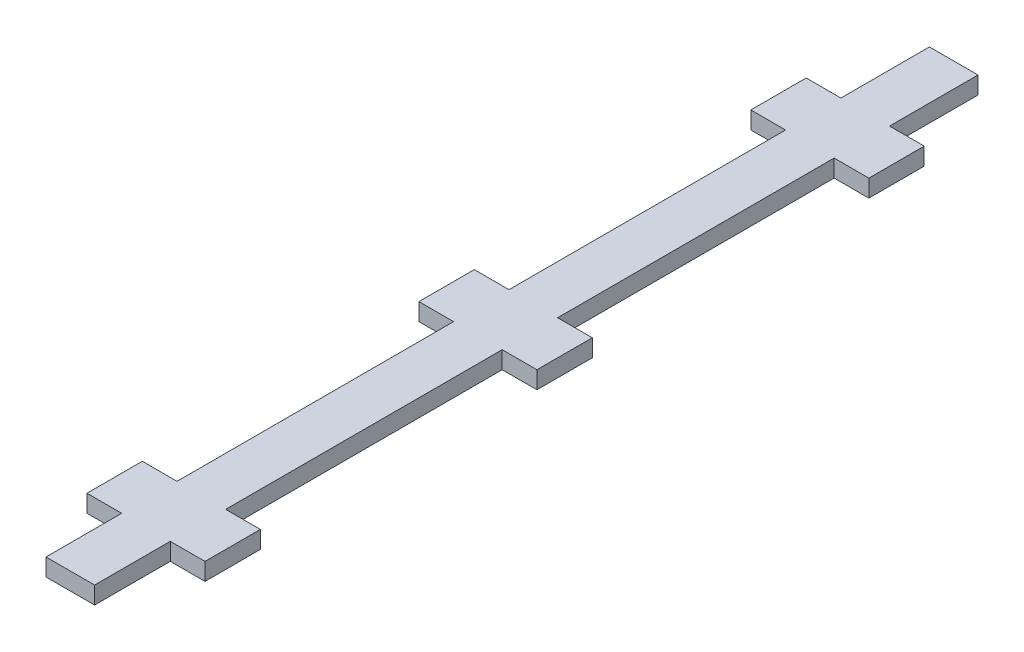
ISO-10303-21;
HEADER;
FILE_DESCRIPTION(('STEP AP214'),'2;1');
FILE_NAME('part.step','',(''),(''),'','','');
FILE_SCHEMA(('AUTOMOTIVE_DESIGN { 1 0 10303 214 1 1 1 1 }'));
ENDSEC;
DATA;
#1=APPLICATION_CONTEXT('core data for automotive mechanical design processes');
#2=APPLICATION_PROTOCOL_DEFINITION('international standard','automotive_design',2000,#1);
#3=PRODUCT_CONTEXT('',#1,'mechanical');
#4=PRODUCT('Part','Part','',(#3));
#5=PRODUCT_RELATED_PRODUCT_CATEGORY('part','',(#4));
#6=PRODUCT_DEFINITION_FORMATION('','',#4);
#7=PRODUCT_DEFINITION_CONTEXT('part definition',#1,'design');
#8=PRODUCT_DEFINITION('design','',#6,#7);
#9=PRODUCT_DEFINITION_SHAPE('','',#8);
#10=(LENGTH_UNIT() NAMED_UNIT(*) SI_UNIT(.MILLI.,.METRE.));
#11=(NAMED_UNIT(*) PLANE_ANGLE_UNIT() SI_UNIT($,.RADIAN.));
#12=(NAMED_UNIT(*) SI_UNIT($,.STERADIAN.) SOLID_ANGLE_UNIT());
#13=UNCERTAINTY_MEASURE_WITH_UNIT(LENGTH_MEASURE(1.E-05),#10,'distance_accuracy_value','');
#14=(GEOMETRIC_REPRESENTATION_CONTEXT(3) GLOBAL_UNCERTAINTY_ASSIGNED_CONTEXT((#13)) GLOBAL_UNIT_ASSIGNED_CONTEXT((#10,
#11,#12)) REPRESENTATION_CONTEXT('',''));
#15=CARTESIAN_POINT('',(0.,0.,0.));
#16=DIRECTION('',(0.,0.,1.));
#17=DIRECTION('',(1.,0.,0.));
#18=AXIS2_PLACEMENT_3D('',#15,#16,#17);
#19=CARTESIAN_POINT('',(-4.445,3.175,0.));
#20=DIRECTION('',(1.,0.,0.));
#21=DIRECTION('',(0.,0.,-1.));
#22=AXIS2_PLACEMENT_3D('',#19,#20,#21);
#23=PLANE('',#22);
#24=DIRECTION('',(0.,0.,1.));
#25=VECTOR('',#24,1.);
#26=CARTESIAN_POINT('',(-4.445,0.,0.));
#27=LINE('',#26,#25);
#28=CARTESIAN_POINT('',(-4.445,0.,-13.843));
#29=VERTEX_POINT('',#28);
#30=CARTESIAN_POINT('',(-4.445,0.,0.));
#31=VERTEX_POINT('',#30);
#32=EDGE_CURVE('E249',#29,#31,#27,.T.);
#33=ORIENTED_EDGE('',*,*,#32,.T.);
#34=DIRECTION('',(0.,-1.,0.));
#35=VECTOR('',#34,1.);
#36=CARTESIAN_POINT('',(-4.445,3.175,0.));
#37=LINE('',#36,#35);
#38=CARTESIAN_POINT('',(-4.445,3.175,0.));
#39=VERTEX_POINT('',#38);
#40=EDGE_CURVE('E11',#39,#31,#37,.T.);
#41=ORIENTED_EDGE('',*,*,#40,.F.);
#42=DIRECTION('',(0.,0.,1.));
#43=VECTOR('',#42,1.);
#44=CARTESIAN_POINT('',(-4.445,3.175,0.));
#45=LINE('',#44,#43);
#46=CARTESIAN_POINT('',(-4.445,3.175,-13.843));
#47=VERTEX_POINT('',#46);
#48=EDGE_CURVE('E303',#47,#39,#45,.T.);
#49=ORIENTED_EDGE('',*,*,#48,.F.);
#50=DIRECTION('',(0.,-1.,0.));
#51=VECTOR('',#50,1.);
#52=CARTESIAN_POINT('',(-4.445,3.175,-13.843));
#53=LINE('',#52,#51);
#54=EDGE_CURVE('E245',#47,#29,#53,.T.);
#55=ORIENTED_EDGE('',*,*,#54,.T.);
#56=EDGE_LOOP('',(#33,#41,#49,#55));
#57=FACE_BOUND('',#56,.T.);
#58=ADVANCED_FACE('F33',(#57),#23,.F.);
#59=CARTESIAN_POINT('',(4.445,3.175,0.));
#60=DIRECTION('',(0.,0.,-1.));
#61=DIRECTION('',(-1.,0.,0.));
#62=AXIS2_PLACEMENT_3D('',#59,#60,#61);
#63=PLANE('',#62);
#64=DIRECTION('',(1.,0.,0.));
#65=VECTOR('',#64,1.);
#66=CARTESIAN_POINT('',(4.445,0.,0.));
#67=LINE('',#66,#65);
#68=CARTESIAN_POINT('',(4.445,0.,0.));
#69=VERTEX_POINT('',#68);
#70=EDGE_CURVE('E252',#31,#69,#67,.T.);
#71=ORIENTED_EDGE('',*,*,#70,.T.);
#72=DIRECTION('',(0.,-1.,0.));
#73=VECTOR('',#72,1.);
#74=CARTESIAN_POINT('',(4.445,3.175,0.));
#75=LINE('',#74,#73);
#76=CARTESIAN_POINT('',(4.445,3.175,0.));
#77=VERTEX_POINT('',#76);
#78=EDGE_CURVE('E41',#77,#69,#75,.T.);
#79=ORIENTED_EDGE('',*,*,#78,.F.);
#80=DIRECTION('',(1.,0.,0.));
#81=VECTOR('',#80,1.);
#82=CARTESIAN_POINT('',(4.445,3.175,0.));
#83=LINE('',#82,#81);
#84=EDGE_CURVE('E152',#39,#77,#83,.T.);
#85=ORIENTED_EDGE('',*,*,#84,.F.);
#86=ORIENTED_EDGE('',*,*,#40,.T.);
#87=EDGE_LOOP('',(#71,#79,#85,#86));
#88=FACE_BOUND('',#87,.T.);
#89=ADVANCED_FACE('F461',(#88),#63,.F.);
#90=CARTESIAN_POINT('',(4.445,3.175,0.));
#91=DIRECTION('',(-1.,0.,0.));
#92=DIRECTION('',(0.,0.,1.));
#93=AXIS2_PLACEMENT_3D('',#90,#91,#92);
#94=PLANE('',#93);
#95=DIRECTION('',(0.,0.,-1.));
#96=VECTOR('',#95,1.);
#97=CARTESIAN_POINT('',(4.445,0.,0.));
#98=LINE('',#97,#96);
#99=CARTESIAN_POINT('',(4.445,0.,-13.843));
#100=VERTEX_POINT('',#99);
#101=EDGE_CURVE('E254',#69,#100,#98,.T.);
#102=ORIENTED_EDGE('',*,*,#101,.T.);
#103=DIRECTION('',(0.,-1.,0.));
#104=VECTOR('',#103,1.);
#105=CARTESIAN_POINT('',(4.445,3.175,-13.843));
#106=LINE('',#105,#104);
#107=CARTESIAN_POINT('',(4.445,3.175,-13.843));
#108=VERTEX_POINT('',#107);
#109=EDGE_CURVE('E370',#108,#100,#106,.T.);
#110=ORIENTED_EDGE('',*,*,#109,.F.);
#111=DIRECTION('',(0.,0.,-1.));
#112=VECTOR('',#111,1.);
#113=CARTESIAN_POINT('',(4.445,3.175,0.));
#114=LINE('',#113,#112);
#115=EDGE_CURVE('E378',#77,#108,#114,.T.);
#116=ORIENTED_EDGE('',*,*,#115,.F.);
#117=ORIENTED_EDGE('',*,*,#78,.T.);
#118=EDGE_LOOP('',(#102,#110,#116,#117));
#119=FACE_BOUND('',#118,.T.);
#120=ADVANCED_FACE('F376',(#119),#94,.F.);
#121=CARTESIAN_POINT('',(4.445,3.175,-13.843));
#122=DIRECTION('',(0.,0.,-1.));
#123=DIRECTION('',(-1.,0.,0.));
#124=AXIS2_PLACEMENT_3D('',#121,#122,#123);
#125=PLANE('',#124);
#126=DIRECTION('',(1.,0.,0.));
#127=VECTOR('',#126,1.);
#128=CARTESIAN_POINT('',(4.445,0.,-13.843));
#129=LINE('',#128,#127);
#130=CARTESIAN_POINT('',(10.795,0.,-13.843));
#131=VERTEX_POINT('',#130);
#132=EDGE_CURVE('E256',#100,#131,#129,.T.);
#133=ORIENTED_EDGE('',*,*,#132,.T.);
#134=DIRECTION('',(0.,-1.,0.));
#135=VECTOR('',#134,1.);
#136=CARTESIAN_POINT('',(10.795,3.175,-13.843));
#137=LINE('',#136,#135);
#138=CARTESIAN_POINT('',(10.795,3.175,-13.843));
#139=VERTEX_POINT('',#138);
#140=EDGE_CURVE('E367',#139,#131,#137,.T.);
#141=ORIENTED_EDGE('',*,*,#140,.F.);
#142=DIRECTION('',(1.,0.,0.));
#143=VECTOR('',#142,1.);
#144=CARTESIAN_POINT('',(4.445,3.175,-13.843));
#145=LINE('',#144,#143);
#146=EDGE_CURVE('E396',#108,#139,#145,.T.);
#147=ORIENTED_EDGE('',*,*,#146,.F.);
#148=ORIENTED_EDGE('',*,*,#109,.T.);
#149=EDGE_LOOP('',(#133,#141,#147,#148));
#150=FACE_BOUND('',#149,.T.);
#151=ADVANCED_FACE('F387',(#150),#125,.F.);
#152=CARTESIAN_POINT('',(10.795,3.175,-13.843));
#153=DIRECTION('',(-1.,0.,0.));
#154=DIRECTION('',(0.,0.,1.));
#155=AXIS2_PLACEMENT_3D('',#152,#153,#154);
#156=PLANE('',#155);
#157=DIRECTION('',(0.,0.,-1.));
#158=VECTOR('',#157,1.);
#159=CARTESIAN_POINT('',(10.795,0.,-13.843));
#160=LINE('',#159,#158);
#161=CARTESIAN_POINT('',(10.795,0.,-23.974869246));
#162=VERTEX_POINT('',#161);
#163=EDGE_CURVE('E258',#131,#162,#160,.T.);
#164=ORIENTED_EDGE('',*,*,#163,.T.);
#165=DIRECTION('',(0.,-1.,0.));
#166=VECTOR('',#165,1.);
#167=CARTESIAN_POINT('',(10.795,3.175,-23.974869246));
#168=LINE('',#167,#166);
#169=CARTESIAN_POINT('',(10.795,3.175,-23.974869246));
#170=VERTEX_POINT('',#169);
#171=EDGE_CURVE('E364',#170,#162,#168,.T.);
#172=ORIENTED_EDGE('',*,*,#171,.F.);
#173=DIRECTION('',(0.,0.,-1.));
#174=VECTOR('',#173,1.);
#175=CARTESIAN_POINT('',(10.795,3.175,-13.843));
#176=LINE('',#175,#174);
#177=EDGE_CURVE('E393',#139,#170,#176,.T.);
#178=ORIENTED_EDGE('',*,*,#177,.F.);
#179=ORIENTED_EDGE('',*,*,#140,.T.);
#180=EDGE_LOOP('',(#164,#172,#178,#179));
#181=FACE_BOUND('',#180,.T.);
#182=ADVANCED_FACE('F391',(#181),#156,.F.);
#183=CARTESIAN_POINT('',(10.795,3.175,-23.974869246));
#184=DIRECTION('',(0.,0.,1.));
#185=DIRECTION('',(1.,0.,0.));
#186=AXIS2_PLACEMENT_3D('',#183,#184,#185);
#187=PLANE('',#186);
#188=DIRECTION('',(-1.,0.,0.));
#189=VECTOR('',#188,1.);
#190=CARTESIAN_POINT('',(10.795,0.,-23.974869246));
#191=LINE('',#190,#189);
#192=CARTESIAN_POINT('',(4.445,0.,-23.974869246));
#193=VERTEX_POINT('',#192);
#194=EDGE_CURVE('E260',#162,#193,#191,.T.);
#195=ORIENTED_EDGE('',*,*,#194,.T.);
#196=DIRECTION('',(0.,-1.,0.));
#197=VECTOR('',#196,1.);
#198=CARTESIAN_POINT('',(4.445,3.175,-23.974869246));
#199=LINE('',#198,#197);
#200=CARTESIAN_POINT('',(4.445,3.175,-23.974869246));
#201=VERTEX_POINT('',#200);
#202=EDGE_CURVE('E361',#201,#193,#199,.T.);
#203=ORIENTED_EDGE('',*,*,#202,.F.);
#204=DIRECTION('',(-1.,0.,0.));
#205=VECTOR('',#204,1.);
#206=CARTESIAN_POINT('',(10.795,3.175,-23.974869246));
#207=LINE('',#206,#205);
#208=EDGE_CURVE('E395',#170,#201,#207,.T.);
#209=ORIENTED_EDGE('',*,*,#208,.F.);
#210=ORIENTED_EDGE('',*,*,#171,.T.);
#211=EDGE_LOOP('',(#195,#203,#209,#210));
#212=FACE_BOUND('',#211,.T.);
#213=ADVANCED_FACE('F474',(#212),#187,.F.);
#214=CARTESIAN_POINT('',(4.445,3.175,-23.974869246));
#215=DIRECTION('',(-1.,0.,0.));
#216=DIRECTION('',(0.,0.,1.));
#217=AXIS2_PLACEMENT_3D('',#214,#215,#216);
#218=PLANE('',#217);
#219=DIRECTION('',(0.,0.,-1.));
#220=VECTOR('',#219,1.);
#221=CARTESIAN_POINT('',(4.445,0.,-23.974869246));
#222=LINE('',#221,#220);
#223=CARTESIAN_POINT('',(4.445,0.,-74.564887446));
#224=VERTEX_POINT('',#223);
#225=EDGE_CURVE('E262',#193,#224,#222,.T.);
#226=ORIENTED_EDGE('',*,*,#225,.T.);
#227=DIRECTION('',(0.,-1.,0.));
#228=VECTOR('',#227,1.);
#229=CARTESIAN_POINT('',(4.445,3.175,-74.564887446));
#230=LINE('',#229,#228);
#231=CARTESIAN_POINT('',(4.445,3.175,-74.564887446));
#232=VERTEX_POINT('',#231);
#233=EDGE_CURVE('E358',#232,#224,#230,.T.);
#234=ORIENTED_EDGE('',*,*,#233,.F.);
#235=DIRECTION('',(0.,0.,-1.));
#236=VECTOR('',#235,1.);
#237=CARTESIAN_POINT('',(4.445,3.175,-23.974869246));
#238=LINE('',#237,#236);
#239=EDGE_CURVE('E398',#201,#232,#238,.T.);
#240=ORIENTED_EDGE('',*,*,#239,.F.);
#241=ORIENTED_EDGE('',*,*,#202,.T.);
#242=EDGE_LOOP('',(#226,#234,#240,#241));
#243=FACE_BOUND('',#242,.T.);
#244=ADVANCED_FACE('F477',(#243),#218,.F.);
#245=CARTESIAN_POINT('',(4.445,3.175,-74.564887446));
#246=DIRECTION('',(0.,0.,-1.));
#247=DIRECTION('',(-1.,0.,0.));
#248=AXIS2_PLACEMENT_3D('',#245,#246,#247);
#249=PLANE('',#248);
#250=DIRECTION('',(1.,0.,0.));
#251=VECTOR('',#250,1.);
#252=CARTESIAN_POINT('',(4.445,0.,-74.564887446));
#253=LINE('',#252,#251);
#254=CARTESIAN_POINT('',(10.795,0.,-74.564887446));
#255=VERTEX_POINT('',#254);
#256=EDGE_CURVE('E264',#224,#255,#253,.T.);
#257=ORIENTED_EDGE('',*,*,#256,.T.);
#258=DIRECTION('',(0.,-1.,0.));
#259=VECTOR('',#258,1.);
#260=CARTESIAN_POINT('',(10.795,3.175,-74.564887446));
#261=LINE('',#260,#259);
#262=CARTESIAN_POINT('',(10.795,3.175,-74.564887446));
#263=VERTEX_POINT('',#262);
#264=EDGE_CURVE('E355',#263,#255,#261,.T.);
#265=ORIENTED_EDGE('',*,*,#264,.F.);
#266=DIRECTION('',(1.,0.,0.));
#267=VECTOR('',#266,1.);
#268=CARTESIAN_POINT('',(4.445,3.175,-74.564887446));
#269=LINE('',#268,#267);
#270=EDGE_CURVE('E404',#232,#263,#269,.T.);
#271=ORIENTED_EDGE('',*,*,#270,.F.);
#272=ORIENTED_EDGE('',*,*,#233,.T.);
#273=EDGE_LOOP('',(#257,#265,#271,#272));
#274=FACE_BOUND('',#273,.T.);
#275=ADVANCED_FACE('F481',(#274),#249,.F.);
#276=CARTESIAN_POINT('',(10.795,3.175,-74.564887446));
#277=DIRECTION('',(-1.,0.,0.));
#278=DIRECTION('',(0.,0.,1.));
#279=AXIS2_PLACEMENT_3D('',#276,#277,#278);
#280=PLANE('',#279);
#281=DIRECTION('',(0.,0.,-1.));
#282=VECTOR('',#281,1.);
#283=CARTESIAN_POINT('',(10.795,0.,-74.564887446));
#284=LINE('',#283,#282);
#285=CARTESIAN_POINT('',(10.795,0.,-84.696756692));
#286=VERTEX_POINT('',#285);
#287=EDGE_CURVE('E266',#255,#286,#284,.T.);
#288=ORIENTED_EDGE('',*,*,#287,.T.);
#289=DIRECTION('',(0.,-1.,0.));
#290=VECTOR('',#289,1.);
#291=CARTESIAN_POINT('',(10.795,3.175,-84.696756692));
#292=LINE('',#291,#290);
#293=CARTESIAN_POINT('',(10.795,3.175,-84.696756692));
#294=VERTEX_POINT('',#293);
#295=EDGE_CURVE('E352',#294,#286,#292,.T.);
#296=ORIENTED_EDGE('',*,*,#295,.F.);
#297=DIRECTION('',(0.,0.,-1.));
#298=VECTOR('',#297,1.);
#299=CARTESIAN_POINT('',(10.795,3.175,-74.564887446));
#300=LINE('',#299,#298);
#301=EDGE_CURVE('E406',#263,#294,#300,.T.);
#302=ORIENTED_EDGE('',*,*,#301,.F.);
#303=ORIENTED_EDGE('',*,*,#264,.T.);
#304=EDGE_LOOP('',(#288,#296,#302,#303));
#305=FACE_BOUND('',#304,.T.);
#306=ADVANCED_FACE('F485',(#305),#280,.F.);
#307=CARTESIAN_POINT('',(10.795,3.175,-84.696756692));
#308=DIRECTION('',(0.,0.,1.));
#309=DIRECTION('',(1.,0.,0.));
#310=AXIS2_PLACEMENT_3D('',#307,#308,#309);
#311=PLANE('',#310);
#312=DIRECTION('',(-1.,0.,0.));
#313=VECTOR('',#312,1.);
#314=CARTESIAN_POINT('',(10.795,0.,-84.696756692));
#315=LINE('',#314,#313);
#316=CARTESIAN_POINT('',(4.445,0.,-84.696756692));
#317=VERTEX_POINT('',#316);
#318=EDGE_CURVE('E268',#286,#317,#315,.T.);
#319=ORIENTED_EDGE('',*,*,#318,.T.);
#320=DIRECTION('',(0.,-1.,0.));
#321=VECTOR('',#320,1.);
#322=CARTESIAN_POINT('',(4.445,3.175,-84.696756692));
#323=LINE('',#322,#321);
#324=CARTESIAN_POINT('',(4.445,3.175,-84.696756692));
#325=VERTEX_POINT('',#324);
#326=EDGE_CURVE('E349',#325,#317,#323,.T.);
#327=ORIENTED_EDGE('',*,*,#326,.F.);
#328=DIRECTION('',(-1.,0.,0.));
#329=VECTOR('',#328,1.);
#330=CARTESIAN_POINT('',(10.795,3.175,-84.696756692));
#331=LINE('',#330,#329);
#332=EDGE_CURVE('E408',#294,#325,#331,.T.);
#333=ORIENTED_EDGE('',*,*,#332,.F.);
#334=ORIENTED_EDGE('',*,*,#295,.T.);
#335=EDGE_LOOP('',(#319,#327,#333,#334));
#336=FACE_BOUND('',#335,.T.);
#337=ADVANCED_FACE('F489',(#336),#311,.F.);
#338=CARTESIAN_POINT('',(4.445,3.175,-84.696756692));
#339=DIRECTION('',(-1.,0.,0.));
#340=DIRECTION('',(0.,0.,1.));
#341=AXIS2_PLACEMENT_3D('',#338,#339,#340);
#342=PLANE('',#341);
#343=DIRECTION('',(0.,0.,-1.));
#344=VECTOR('',#343,1.);
#345=CARTESIAN_POINT('',(4.445,0.,-84.696756692));
#346=LINE('',#345,#344);
#347=CARTESIAN_POINT('',(4.445,0.,-135.286774892));
#348=VERTEX_POINT('',#347);
#349=EDGE_CURVE('E270',#317,#348,#346,.T.);
#350=ORIENTED_EDGE('',*,*,#349,.T.);
#351=DIRECTION('',(0.,-1.,0.));
#352=VECTOR('',#351,1.);
#353=CARTESIAN_POINT('',(4.445,3.175,-135.286774892));
#354=LINE('',#353,#352);
#355=CARTESIAN_POINT('',(4.445,3.175,-135.286774892));
#356=VERTEX_POINT('',#355);
#357=EDGE_CURVE('E346',#356,#348,#354,.T.);
#358=ORIENTED_EDGE('',*,*,#357,.F.);
#359=DIRECTION('',(0.,0.,-1.));
#360=VECTOR('',#359,1.);
#361=CARTESIAN_POINT('',(4.445,3.175,-84.696756692));
#362=LINE('',#361,#360);
#363=EDGE_CURVE('E410',#325,#356,#362,.T.);
#364=ORIENTED_EDGE('',*,*,#363,.F.);
#365=ORIENTED_EDGE('',*,*,#326,.T.);
#366=EDGE_LOOP('',(#350,#358,#364,#365));
#367=FACE_BOUND('',#366,.T.);
#368=ADVANCED_FACE('F493',(#367),#342,.F.);
#369=CARTESIAN_POINT('',(4.445,3.175,-135.286774892));
#370=DIRECTION('',(0.,0.,-1.));
#371=DIRECTION('',(-1.,0.,0.));
#372=AXIS2_PLACEMENT_3D('',#369,#370,#371);
#373=PLANE('',#372);
#374=DIRECTION('',(1.,0.,0.));
#375=VECTOR('',#374,1.);
#376=CARTESIAN_POINT('',(4.445,0.,-135.286774892));
#377=LINE('',#376,#375);
#378=CARTESIAN_POINT('',(10.795,0.,-135.286774892));
#379=VERTEX_POINT('',#378);
#380=EDGE_CURVE('E272',#348,#379,#377,.T.);
#381=ORIENTED_EDGE('',*,*,#380,.T.);
#382=DIRECTION('',(0.,-1.,0.));
#383=VECTOR('',#382,1.);
#384=CARTESIAN_POINT('',(10.795,3.175,-135.286774892));
#385=LINE('',#384,#383);
#386=CARTESIAN_POINT('',(10.795,3.175,-135.286774892));
#387=VERTEX_POINT('',#386);
#388=EDGE_CURVE('E343',#387,#379,#385,.T.);
#389=ORIENTED_EDGE('',*,*,#388,.F.);
#390=DIRECTION('',(1.,0.,0.));
#391=VECTOR('',#390,1.);
#392=CARTESIAN_POINT('',(4.445,3.175,-135.286774892));
#393=LINE('',#392,#391);
#394=EDGE_CURVE('E412',#356,#387,#393,.T.);
#395=ORIENTED_EDGE('',*,*,#394,.F.);
#396=ORIENTED_EDGE('',*,*,#357,.T.);
#397=EDGE_LOOP('',(#381,#389,#395,#396));
#398=FACE_BOUND('',#397,.T.);
#399=ADVANCED_FACE('F497',(#398),#373,.F.);
#400=CARTESIAN_POINT('',(10.795,3.175,-135.286774892));
#401=DIRECTION('',(-1.,0.,0.));
#402=DIRECTION('',(0.,0.,1.));
#403=AXIS2_PLACEMENT_3D('',#400,#401,#402);
#404=PLANE('',#403);
#405=DIRECTION('',(0.,0.,-1.));
#406=VECTOR('',#405,1.);
#407=CARTESIAN_POINT('',(10.795,0.,-135.286774892));
#408=LINE('',#407,#406);
#409=CARTESIAN_POINT('',(10.795,0.,-145.418644138));
#410=VERTEX_POINT('',#409);
#411=EDGE_CURVE('E274',#379,#410,#408,.T.);
#412=ORIENTED_EDGE('',*,*,#411,.T.);
#413=DIRECTION('',(0.,-1.,0.));
#414=VECTOR('',#413,1.);
#415=CARTESIAN_POINT('',(10.795,3.175,-145.418644138));
#416=LINE('',#415,#414);
#417=CARTESIAN_POINT('',(10.795,3.175,-145.418644138));
#418=VERTEX_POINT('',#417);
#419=EDGE_CURVE('E340',#418,#410,#416,.T.);
#420=ORIENTED_EDGE('',*,*,#419,.F.);
#421=DIRECTION('',(0.,0.,-1.));
#422=VECTOR('',#421,1.);
#423=CARTESIAN_POINT('',(10.795,3.175,-135.286774892));
#424=LINE('',#423,#422);
#425=EDGE_CURVE('E414',#387,#418,#424,.T.);
#426=ORIENTED_EDGE('',*,*,#425,.F.);
#427=ORIENTED_EDGE('',*,*,#388,.T.);
#428=EDGE_LOOP('',(#412,#420,#426,#427));
#429=FACE_BOUND('',#428,.T.);
#430=ADVANCED_FACE('F501',(#429),#404,.F.);
#431=CARTESIAN_POINT('',(10.795,3.175,-145.418644138));
#432=DIRECTION('',(0.,0.,1.));
#433=DIRECTION('',(1.,0.,0.));
#434=AXIS2_PLACEMENT_3D('',#431,#432,#433);
#435=PLANE('',#434);
#436=DIRECTION('',(-1.,0.,0.));
#437=VECTOR('',#436,1.);
#438=CARTESIAN_POINT('',(10.795,0.,-145.418644138));
#439=LINE('',#438,#437);
#440=CARTESIAN_POINT('',(4.445,0.,-145.418644138));
#441=VERTEX_POINT('',#440);
#442=EDGE_CURVE('E276',#410,#441,#439,.T.);
#443=ORIENTED_EDGE('',*,*,#442,.T.);
#444=DIRECTION('',(0.,-1.,0.));
#445=VECTOR('',#444,1.);
#446=CARTESIAN_POINT('',(4.445,3.175,-145.418644138));
#447=LINE('',#446,#445);
#448=CARTESIAN_POINT('',(4.445,3.175,-145.418644138));
#449=VERTEX_POINT('',#448);
#450=EDGE_CURVE('E337',#449,#441,#447,.T.);
#451=ORIENTED_EDGE('',*,*,#450,.F.);
#452=DIRECTION('',(-1.,0.,0.));
#453=VECTOR('',#452,1.);
#454=CARTESIAN_POINT('',(10.795,3.175,-145.418644138));
#455=LINE('',#454,#453);
#456=EDGE_CURVE('E416',#418,#449,#455,.T.);
#457=ORIENTED_EDGE('',*,*,#456,.F.);
#458=ORIENTED_EDGE('',*,*,#419,.T.);
#459=EDGE_LOOP('',(#443,#451,#457,#458));
#460=FACE_BOUND('',#459,.T.);
#461=ADVANCED_FACE('F505',(#460),#435,.F.);
#462=CARTESIAN_POINT('',(4.445,3.175,-145.418644138));
#463=DIRECTION('',(-1.,0.,0.));
#464=DIRECTION('',(0.,0.,1.));
#465=AXIS2_PLACEMENT_3D('',#462,#463,#464);
#466=PLANE('',#465);
#467=DIRECTION('',(0.,0.,-1.));
#468=VECTOR('',#467,1.);
#469=CARTESIAN_POINT('',(4.445,0.,-145.418644138));
#470=LINE('',#469,#468);
#471=CARTESIAN_POINT('',(4.445,0.,-161.605283342));
#472=VERTEX_POINT('',#471);
#473=EDGE_CURVE('E278',#441,#472,#470,.T.);
#474=ORIENTED_EDGE('',*,*,#473,.T.);
#475=DIRECTION('',(0.,-1.,0.));
#476=VECTOR('',#475,1.);
#477=CARTESIAN_POINT('',(4.445,3.175,-161.605283342));
#478=LINE('',#477,#476);
#479=CARTESIAN_POINT('',(4.445,3.175,-161.605283342));
#480=VERTEX_POINT('',#479);
#481=EDGE_CURVE('E334',#480,#472,#478,.T.);
#482=ORIENTED_EDGE('',*,*,#481,.F.);
#483=DIRECTION('',(0.,0.,-1.));
#484=VECTOR('',#483,1.);
#485=CARTESIAN_POINT('',(4.445,3.175,-145.418644138));
#486=LINE('',#485,#484);
#487=EDGE_CURVE('E418',#449,#480,#486,.T.);
#488=ORIENTED_EDGE('',*,*,#487,.F.);
#489=ORIENTED_EDGE('',*,*,#450,.T.);
#490=EDGE_LOOP('',(#474,#482,#488,#489));
#491=FACE_BOUND('',#490,.T.);
#492=ADVANCED_FACE('F509',(#491),#466,.F.);
#493=CARTESIAN_POINT('',(-4.445,3.175,-161.605283342));
#494=DIRECTION('',(0.,0.,1.));
#495=DIRECTION('',(1.,0.,0.));
#496=AXIS2_PLACEMENT_3D('',#493,#494,#495);
#497=PLANE('',#496);
#498=DIRECTION('',(-1.,0.,0.));
#499=VECTOR('',#498,1.);
#500=CARTESIAN_POINT('',(-4.445,0.,-161.605283342));
#501=LINE('',#500,#499);
#502=CARTESIAN_POINT('',(-4.445,0.,-161.605283342));
#503=VERTEX_POINT('',#502);
#504=EDGE_CURVE('E280',#472,#503,#501,.T.);
#505=ORIENTED_EDGE('',*,*,#504,.T.);
#506=DIRECTION('',(0.,-1.,0.));
#507=VECTOR('',#506,1.);
#508=CARTESIAN_POINT('',(-4.445,3.175,-161.605283342));
#509=LINE('',#508,#507);
#510=CARTESIAN_POINT('',(-4.445,3.175,-161.605283342));
#511=VERTEX_POINT('',#510);
#512=EDGE_CURVE('E331',#511,#503,#509,.T.);
#513=ORIENTED_EDGE('',*,*,#512,.F.);
#514=DIRECTION('',(-1.,0.,0.));
#515=VECTOR('',#514,1.);
#516=CARTESIAN_POINT('',(-4.445,3.175,-161.605283342));
#517=LINE('',#516,#515);
#518=EDGE_CURVE('E420',#480,#511,#517,.T.);
#519=ORIENTED_EDGE('',*,*,#518,.F.);
#520=ORIENTED_EDGE('',*,*,#481,.T.);
#521=EDGE_LOOP('',(#505,#513,#519,#520));
#522=FACE_BOUND('',#521,.T.);
#523=ADVANCED_FACE('F513',(#522),#497,.F.);
#524=CARTESIAN_POINT('',(-4.445,3.175,-145.418644138));
#525=DIRECTION('',(1.,0.,0.));
#526=DIRECTION('',(0.,0.,-1.));
#527=AXIS2_PLACEMENT_3D('',#524,#525,#526);
#528=PLANE('',#527);
#529=DIRECTION('',(0.,0.,1.));
#530=VECTOR('',#529,1.);
#531=CARTESIAN_POINT('',(-4.445,0.,-145.418644138));
#532=LINE('',#531,#530);
#533=CARTESIAN_POINT('',(-4.445,0.,-145.418644138));
#534=VERTEX_POINT('',#533);
#535=EDGE_CURVE('E282',#503,#534,#532,.T.);
#536=ORIENTED_EDGE('',*,*,#535,.T.);
#537=DIRECTION('',(0.,-1.,0.));
#538=VECTOR('',#537,1.);
#539=CARTESIAN_POINT('',(-4.445,3.175,-145.418644138));
#540=LINE('',#539,#538);
#541=CARTESIAN_POINT('',(-4.445,3.175,-145.418644138));
#542=VERTEX_POINT('',#541);
#543=EDGE_CURVE('E328',#542,#534,#540,.T.);
#544=ORIENTED_EDGE('',*,*,#543,.F.);
#545=DIRECTION('',(0.,0.,1.));
#546=VECTOR('',#545,1.);
#547=CARTESIAN_POINT('',(-4.445,3.175,-145.418644138));
#548=LINE('',#547,#546);
#549=EDGE_CURVE('E422',#511,#542,#548,.T.);
#550=ORIENTED_EDGE('',*,*,#549,.F.);
#551=ORIENTED_EDGE('',*,*,#512,.T.);
#552=EDGE_LOOP('',(#536,#544,#550,#551));
#553=FACE_BOUND('',#552,.T.);
#554=ADVANCED_FACE('F517',(#553),#528,.F.);
#555=CARTESIAN_POINT('',(-10.795,3.175,-145.418644138));
#556=DIRECTION('',(0.,0.,1.));
#557=DIRECTION('',(1.,0.,0.));
#558=AXIS2_PLACEMENT_3D('',#555,#556,#557);
#559=PLANE('',#558);
#560=DIRECTION('',(-1.,0.,0.));
#561=VECTOR('',#560,1.);
#562=CARTESIAN_POINT('',(-10.795,0.,-145.418644138));
#563=LINE('',#562,#561);
#564=CARTESIAN_POINT('',(-10.795,0.,-145.418644138));
#565=VERTEX_POINT('',#564);
#566=EDGE_CURVE('E284',#534,#565,#563,.T.);
#567=ORIENTED_EDGE('',*,*,#566,.T.);
#568=DIRECTION('',(0.,-1.,0.));
#569=VECTOR('',#568,1.);
#570=CARTESIAN_POINT('',(-10.795,3.175,-145.418644138));
#571=LINE('',#570,#569);
#572=CARTESIAN_POINT('',(-10.795,3.175,-145.418644138));
#573=VERTEX_POINT('',#572);
#574=EDGE_CURVE('E325',#573,#565,#571,.T.);
#575=ORIENTED_EDGE('',*,*,#574,.F.);
#576=DIRECTION('',(-1.,0.,0.));
#577=VECTOR('',#576,1.);
#578=CARTESIAN_POINT('',(-10.795,3.175,-145.418644138));
#579=LINE('',#578,#577);
#580=EDGE_CURVE('E424',#542,#573,#579,.T.);
#581=ORIENTED_EDGE('',*,*,#580,.F.);
#582=ORIENTED_EDGE('',*,*,#543,.T.);
#583=EDGE_LOOP('',(#567,#575,#581,#582));
#584=FACE_BOUND('',#583,.T.);
#585=ADVANCED_FACE('F521',(#584),#559,.F.);
#586=CARTESIAN_POINT('',(-10.795,3.175,-135.286774892));
#587=DIRECTION('',(1.,0.,0.));
#588=DIRECTION('',(0.,0.,-1.));
#589=AXIS2_PLACEMENT_3D('',#586,#587,#588);
#590=PLANE('',#589);
#591=DIRECTION('',(0.,0.,1.));
#592=VECTOR('',#591,1.);
#593=CARTESIAN_POINT('',(-10.795,0.,-135.286774892));
#594=LINE('',#593,#592);
#595=CARTESIAN_POINT('',(-10.795,0.,-135.286774892));
#596=VERTEX_POINT('',#595);
#597=EDGE_CURVE('E286',#565,#596,#594,.T.);
#598=ORIENTED_EDGE('',*,*,#597,.T.);
#599=DIRECTION('',(0.,-1.,0.));
#600=VECTOR('',#599,1.);
#601=CARTESIAN_POINT('',(-10.795,3.175,-135.286774892));
#602=LINE('',#601,#600);
#603=CARTESIAN_POINT('',(-10.795,3.175,-135.286774892));
#604=VERTEX_POINT('',#603);
#605=EDGE_CURVE('E322',#604,#596,#602,.T.);
#606=ORIENTED_EDGE('',*,*,#605,.F.);
#607=DIRECTION('',(0.,0.,1.));
#608=VECTOR('',#607,1.);
#609=CARTESIAN_POINT('',(-10.795,3.175,-135.286774892));
#610=LINE('',#609,#608);
#611=EDGE_CURVE('E426',#573,#604,#610,.T.);
#612=ORIENTED_EDGE('',*,*,#611,.F.);
#613=ORIENTED_EDGE('',*,*,#574,.T.);
#614=EDGE_LOOP('',(#598,#606,#612,#613));
#615=FACE_BOUND('',#614,.T.);
#616=ADVANCED_FACE('F525',(#615),#590,.F.);
#617=CARTESIAN_POINT('',(-4.445,3.175,-135.286774892));
#618=DIRECTION('',(0.,0.,-1.));
#619=DIRECTION('',(-1.,0.,0.));
#620=AXIS2_PLACEMENT_3D('',#617,#618,#619);
#621=PLANE('',#620);
#622=DIRECTION('',(1.,0.,0.));
#623=VECTOR('',#622,1.);
#624=CARTESIAN_POINT('',(-4.445,0.,-135.286774892));
#625=LINE('',#624,#623);
#626=CARTESIAN_POINT('',(-4.445,0.,-135.286774892));
#627=VERTEX_POINT('',#626);
#628=EDGE_CURVE('E288',#596,#627,#625,.T.);
#629=ORIENTED_EDGE('',*,*,#628,.T.);
#630=DIRECTION('',(0.,-1.,0.));
#631=VECTOR('',#630,1.);
#632=CARTESIAN_POINT('',(-4.445,3.175,-135.286774892));
#633=LINE('',#632,#631);
#634=CARTESIAN_POINT('',(-4.445,3.175,-135.286774892));
#635=VERTEX_POINT('',#634);
#636=EDGE_CURVE('E319',#635,#627,#633,.T.);
#637=ORIENTED_EDGE('',*,*,#636,.F.);
#638=DIRECTION('',(1.,0.,0.));
#639=VECTOR('',#638,1.);
#640=CARTESIAN_POINT('',(-4.445,3.175,-135.286774892));
#641=LINE('',#640,#639);
#642=EDGE_CURVE('E428',#604,#635,#641,.T.);
#643=ORIENTED_EDGE('',*,*,#642,.F.);
#644=ORIENTED_EDGE('',*,*,#605,.T.);
#645=EDGE_LOOP('',(#629,#637,#643,#644));
#646=FACE_BOUND('',#645,.T.);
#647=ADVANCED_FACE('F529',(#646),#621,.F.);
#648=CARTESIAN_POINT('',(-4.445,3.175,-84.696756692));
#649=DIRECTION('',(1.,0.,0.));
#650=DIRECTION('',(0.,0.,-1.));
#651=AXIS2_PLACEMENT_3D('',#648,#649,#650);
#652=PLANE('',#651);
#653=DIRECTION('',(0.,0.,1.));
#654=VECTOR('',#653,1.);
#655=CARTESIAN_POINT('',(-4.445,0.,-84.696756692));
#656=LINE('',#655,#654);
#657=CARTESIAN_POINT('',(-4.445,0.,-84.696756692));
#658=VERTEX_POINT('',#657);
#659=EDGE_CURVE('E290',#627,#658,#656,.T.);
#660=ORIENTED_EDGE('',*,*,#659,.T.);
#661=DIRECTION('',(0.,-1.,0.));
#662=VECTOR('',#661,1.);
#663=CARTESIAN_POINT('',(-4.445,3.175,-84.696756692));
#664=LINE('',#663,#662);
#665=CARTESIAN_POINT('',(-4.445,3.175,-84.696756692));
#666=VERTEX_POINT('',#665);
#667=EDGE_CURVE('E316',#666,#658,#664,.T.);
#668=ORIENTED_EDGE('',*,*,#667,.F.);
#669=DIRECTION('',(0.,0.,1.));
#670=VECTOR('',#669,1.);
#671=CARTESIAN_POINT('',(-4.445,3.175,-84.696756692));
#672=LINE('',#671,#670);
#673=EDGE_CURVE('E430',#635,#666,#672,.T.);
#674=ORIENTED_EDGE('',*,*,#673,.F.);
#675=ORIENTED_EDGE('',*,*,#636,.T.);
#676=EDGE_LOOP('',(#660,#668,#674,#675));
#677=FACE_BOUND('',#676,.T.);
#678=ADVANCED_FACE('F533',(#677),#652,.F.);
#679=CARTESIAN_POINT('',(-10.795,3.175,-84.696756692));
#680=DIRECTION('',(0.,0.,1.));
#681=DIRECTION('',(1.,0.,0.));
#682=AXIS2_PLACEMENT_3D('',#679,#680,#681);
#683=PLANE('',#682);
#684=DIRECTION('',(-1.,0.,0.));
#685=VECTOR('',#684,1.);
#686=CARTESIAN_POINT('',(-10.795,0.,-84.696756692));
#687=LINE('',#686,#685);
#688=CARTESIAN_POINT('',(-10.795,0.,-84.696756692));
#689=VERTEX_POINT('',#688);
#690=EDGE_CURVE('E292',#658,#689,#687,.T.);
#691=ORIENTED_EDGE('',*,*,#690,.T.);
#692=DIRECTION('',(0.,-1.,0.));
#693=VECTOR('',#692,1.);
#694=CARTESIAN_POINT('',(-10.795,3.175,-84.696756692));
#695=LINE('',#694,#693);
#696=CARTESIAN_POINT('',(-10.795,3.175,-84.696756692));
#697=VERTEX_POINT('',#696);
#698=EDGE_CURVE('E313',#697,#689,#695,.T.);
#699=ORIENTED_EDGE('',*,*,#698,.F.);
#700=DIRECTION('',(-1.,0.,0.));
#701=VECTOR('',#700,1.);
#702=CARTESIAN_POINT('',(-10.795,3.175,-84.696756692));
#703=LINE('',#702,#701);
#704=EDGE_CURVE('E432',#666,#697,#703,.T.);
#705=ORIENTED_EDGE('',*,*,#704,.F.);
#706=ORIENTED_EDGE('',*,*,#667,.T.);
#707=EDGE_LOOP('',(#691,#699,#705,#706));
#708=FACE_BOUND('',#707,.T.);
#709=ADVANCED_FACE('F537',(#708),#683,.F.);
#710=CARTESIAN_POINT('',(-10.795,3.175,-74.564887446));
#711=DIRECTION('',(1.,0.,0.));
#712=DIRECTION('',(0.,0.,-1.));
#713=AXIS2_PLACEMENT_3D('',#710,#711,#712);
#714=PLANE('',#713);
#715=DIRECTION('',(0.,0.,1.));
#716=VECTOR('',#715,1.);
#717=CARTESIAN_POINT('',(-10.795,0.,-74.564887446));
#718=LINE('',#717,#716);
#719=CARTESIAN_POINT('',(-10.795,0.,-74.564887446));
#720=VERTEX_POINT('',#719);
#721=EDGE_CURVE('E294',#689,#720,#718,.T.);
#722=ORIENTED_EDGE('',*,*,#721,.T.);
#723=DIRECTION('',(0.,-1.,0.));
#724=VECTOR('',#723,1.);
#725=CARTESIAN_POINT('',(-10.795,3.175,-74.564887446));
#726=LINE('',#725,#724);
#727=CARTESIAN_POINT('',(-10.795,3.175,-74.564887446));
#728=VERTEX_POINT('',#727);
#729=EDGE_CURVE('E310',#728,#720,#726,.T.);
#730=ORIENTED_EDGE('',*,*,#729,.F.);
#731=DIRECTION('',(0.,0.,1.));
#732=VECTOR('',#731,1.);
#733=CARTESIAN_POINT('',(-10.795,3.175,-74.564887446));
#734=LINE('',#733,#732);
#735=EDGE_CURVE('E434',#697,#728,#734,.T.);
#736=ORIENTED_EDGE('',*,*,#735,.F.);
#737=ORIENTED_EDGE('',*,*,#698,.T.);
#738=EDGE_LOOP('',(#722,#730,#736,#737));
#739=FACE_BOUND('',#738,.T.);
#740=ADVANCED_FACE('F541',(#739),#714,.F.);
#741=CARTESIAN_POINT('',(-4.445,3.175,-74.564887446));
#742=DIRECTION('',(0.,0.,-1.));
#743=DIRECTION('',(-1.,0.,0.));
#744=AXIS2_PLACEMENT_3D('',#741,#742,#743);
#745=PLANE('',#744);
#746=DIRECTION('',(1.,0.,0.));
#747=VECTOR('',#746,1.);
#748=CARTESIAN_POINT('',(-4.445,0.,-74.564887446));
#749=LINE('',#748,#747);
#750=CARTESIAN_POINT('',(-4.445,0.,-74.564887446));
#751=VERTEX_POINT('',#750);
#752=EDGE_CURVE('E296',#720,#751,#749,.T.);
#753=ORIENTED_EDGE('',*,*,#752,.T.);
#754=DIRECTION('',(0.,-1.,0.));
#755=VECTOR('',#754,1.);
#756=CARTESIAN_POINT('',(-4.445,3.175,-74.564887446));
#757=LINE('',#756,#755);
#758=CARTESIAN_POINT('',(-4.445,3.175,-74.564887446));
#759=VERTEX_POINT('',#758);
#760=EDGE_CURVE('E307',#759,#751,#757,.T.);
#761=ORIENTED_EDGE('',*,*,#760,.F.);
#762=DIRECTION('',(1.,0.,0.));
#763=VECTOR('',#762,1.);
#764=CARTESIAN_POINT('',(-4.445,3.175,-74.564887446));
#765=LINE('',#764,#763);
#766=EDGE_CURVE('E436',#728,#759,#765,.T.);
#767=ORIENTED_EDGE('',*,*,#766,.F.);
#768=ORIENTED_EDGE('',*,*,#729,.T.);
#769=EDGE_LOOP('',(#753,#761,#767,#768));
#770=FACE_BOUND('',#769,.T.);
#771=ADVANCED_FACE('F442',(#770),#745,.F.);
#772=CARTESIAN_POINT('',(-4.445,3.175,-23.974869246));
#773=DIRECTION('',(1.,0.,0.));
#774=DIRECTION('',(0.,0.,-1.));
#775=AXIS2_PLACEMENT_3D('',#772,#773,#774);
#776=PLANE('',#775);
#777=DIRECTION('',(0.,0.,1.));
#778=VECTOR('',#777,1.);
#779=CARTESIAN_POINT('',(-4.445,0.,-23.974869246));
#780=LINE('',#779,#778);
#781=CARTESIAN_POINT('',(-4.445,0.,-23.974869246));
#782=VERTEX_POINT('',#781);
#783=EDGE_CURVE('E298',#751,#782,#780,.T.);
#784=ORIENTED_EDGE('',*,*,#783,.T.);
#785=DIRECTION('',(0.,-1.,0.));
#786=VECTOR('',#785,1.);
#787=CARTESIAN_POINT('',(-4.445,3.175,-23.974869246));
#788=LINE('',#787,#786);
#789=CARTESIAN_POINT('',(-4.445,3.175,-23.974869246));
#790=VERTEX_POINT('',#789);
#791=EDGE_CURVE('E240',#790,#782,#788,.T.);
#792=ORIENTED_EDGE('',*,*,#791,.F.);
#793=DIRECTION('',(0.,0.,1.));
#794=VECTOR('',#793,1.);
#795=CARTESIAN_POINT('',(-4.445,3.175,-23.974869246));
#796=LINE('',#795,#794);
#797=EDGE_CURVE('E231',#759,#790,#796,.T.);
#798=ORIENTED_EDGE('',*,*,#797,.F.);
#799=ORIENTED_EDGE('',*,*,#760,.T.);
#800=EDGE_LOOP('',(#784,#792,#798,#799));
#801=FACE_BOUND('',#800,.T.);
#802=ADVANCED_FACE('F446',(#801),#776,.F.);
#803=CARTESIAN_POINT('',(-10.795,3.175,-23.974869246));
#804=DIRECTION('',(0.,0.,1.));
#805=DIRECTION('',(1.,0.,0.));
#806=AXIS2_PLACEMENT_3D('',#803,#804,#805);
#807=PLANE('',#806);
#808=DIRECTION('',(-1.,0.,0.));
#809=VECTOR('',#808,1.);
#810=CARTESIAN_POINT('',(-10.795,0.,-23.974869246));
#811=LINE('',#810,#809);
#812=CARTESIAN_POINT('',(-10.795,0.,-23.974869246));
#813=VERTEX_POINT('',#812);
#814=EDGE_CURVE('E239',#782,#813,#811,.T.);
#815=ORIENTED_EDGE('',*,*,#814,.T.);
#816=DIRECTION('',(0.,-1.,0.));
#817=VECTOR('',#816,1.);
#818=CARTESIAN_POINT('',(-10.795,3.175,-23.974869246));
#819=LINE('',#818,#817);
#820=CARTESIAN_POINT('',(-10.795,3.175,-23.974869246));
#821=VERTEX_POINT('',#820);
#822=EDGE_CURVE('E236',#821,#813,#819,.T.);
#823=ORIENTED_EDGE('',*,*,#822,.F.);
#824=DIRECTION('',(-1.,0.,0.));
#825=VECTOR('',#824,1.);
#826=CARTESIAN_POINT('',(-10.795,3.175,-23.974869246));
#827=LINE('',#826,#825);
#828=EDGE_CURVE('E225',#790,#821,#827,.T.);
#829=ORIENTED_EDGE('',*,*,#828,.F.);
#830=ORIENTED_EDGE('',*,*,#791,.T.);
#831=EDGE_LOOP('',(#815,#823,#829,#830));
#832=FACE_BOUND('',#831,.T.);
#833=ADVANCED_FACE('F237',(#832),#807,.F.);
#834=CARTESIAN_POINT('',(-10.795,3.175,-13.843));
#835=DIRECTION('',(1.,0.,0.));
#836=DIRECTION('',(0.,0.,-1.));
#837=AXIS2_PLACEMENT_3D('',#834,#835,#836);
#838=PLANE('',#837);
#839=DIRECTION('',(0.,0.,1.));
#840=VECTOR('',#839,1.);
#841=CARTESIAN_POINT('',(-10.795,0.,-13.843));
#842=LINE('',#841,#840);
#843=CARTESIAN_POINT('',(-10.795,0.,-13.843));
#844=VERTEX_POINT('',#843);
#845=EDGE_CURVE('E138',#813,#844,#842,.T.);
#846=ORIENTED_EDGE('',*,*,#845,.T.);
#847=DIRECTION('',(0.,-1.,0.));
#848=VECTOR('',#847,1.);
#849=CARTESIAN_POINT('',(-10.795,3.175,-13.843));
#850=LINE('',#849,#848);
#851=CARTESIAN_POINT('',(-10.795,3.175,-13.843));
#852=VERTEX_POINT('',#851);
#853=EDGE_CURVE('E241',#852,#844,#850,.T.);
#854=ORIENTED_EDGE('',*,*,#853,.F.);
#855=DIRECTION('',(0.,0.,1.));
#856=VECTOR('',#855,1.);
#857=CARTESIAN_POINT('',(-10.795,3.175,-13.843));
#858=LINE('',#857,#856);
#859=EDGE_CURVE('E229',#821,#852,#858,.T.);
#860=ORIENTED_EDGE('',*,*,#859,.F.);
#861=ORIENTED_EDGE('',*,*,#822,.T.);
#862=EDGE_LOOP('',(#846,#854,#860,#861));
#863=FACE_BOUND('',#862,.T.);
#864=ADVANCED_FACE('F243',(#863),#838,.F.);
#865=CARTESIAN_POINT('',(-4.445,3.175,-13.843));
#866=DIRECTION('',(0.,0.,-1.));
#867=DIRECTION('',(-1.,0.,0.));
#868=AXIS2_PLACEMENT_3D('',#865,#866,#867);
#869=PLANE('',#868);
#870=DIRECTION('',(1.,0.,0.));
#871=VECTOR('',#870,1.);
#872=CARTESIAN_POINT('',(-4.445,0.,-13.843));
#873=LINE('',#872,#871);
#874=EDGE_CURVE('E144',#844,#29,#873,.T.);
#875=ORIENTED_EDGE('',*,*,#874,.T.);
#876=ORIENTED_EDGE('',*,*,#54,.F.);
#877=DIRECTION('',(1.,0.,0.));
#878=VECTOR('',#877,1.);
#879=CARTESIAN_POINT('',(-4.445,3.175,-13.843));
#880=LINE('',#879,#878);
#881=EDGE_CURVE('E49',#852,#47,#880,.T.);
#882=ORIENTED_EDGE('',*,*,#881,.F.);
#883=ORIENTED_EDGE('',*,*,#853,.T.);
#884=EDGE_LOOP('',(#875,#876,#882,#883));
#885=FACE_BOUND('',#884,.T.);
#886=ADVANCED_FACE('F450',(#885),#869,.F.);
#887=CARTESIAN_POINT('',(0.,3.175,0.));
#888=DIRECTION('',(0.,1.,0.));
#889=DIRECTION('',(0.,0.,1.));
#890=AXIS2_PLACEMENT_3D('',#887,#888,#889);
#891=PLANE('',#890);
#892=ORIENTED_EDGE('',*,*,#48,.T.);
#893=ORIENTED_EDGE('',*,*,#84,.T.);
#894=ORIENTED_EDGE('',*,*,#115,.T.);
#895=ORIENTED_EDGE('',*,*,#146,.T.);
#896=ORIENTED_EDGE('',*,*,#177,.T.);
#897=ORIENTED_EDGE('',*,*,#208,.T.);
#898=ORIENTED_EDGE('',*,*,#239,.T.);
#899=ORIENTED_EDGE('',*,*,#270,.T.);
#900=ORIENTED_EDGE('',*,*,#301,.T.);
#901=ORIENTED_EDGE('',*,*,#332,.T.);
#902=ORIENTED_EDGE('',*,*,#363,.T.);
#903=ORIENTED_EDGE('',*,*,#394,.T.);
#904=ORIENTED_EDGE('',*,*,#425,.T.);
#905=ORIENTED_EDGE('',*,*,#456,.T.);
#906=ORIENTED_EDGE('',*,*,#487,.T.);
#907=ORIENTED_EDGE('',*,*,#518,.T.);
#908=ORIENTED_EDGE('',*,*,#549,.T.);
#909=ORIENTED_EDGE('',*,*,#580,.T.);
#910=ORIENTED_EDGE('',*,*,#611,.T.);
#911=ORIENTED_EDGE('',*,*,#642,.T.);
#912=ORIENTED_EDGE('',*,*,#673,.T.);
#913=ORIENTED_EDGE('',*,*,#704,.T.);
#914=ORIENTED_EDGE('',*,*,#735,.T.);
#915=ORIENTED_EDGE('',*,*,#766,.T.);
#916=ORIENTED_EDGE('',*,*,#797,.T.);
#917=ORIENTED_EDGE('',*,*,#828,.T.);
#918=ORIENTED_EDGE('',*,*,#859,.T.);
#919=ORIENTED_EDGE('',*,*,#881,.T.);
#920=EDGE_LOOP('',(#892,#893,#894,#895,#896,#897,#898,#899,#900,#901,#902,#903,#904,#905,#906,
#907,#908,#909,#910,#911,#912,#913,#914,#915,#916,#917,#918,#919));
#921=FACE_BOUND('',#920,.T.);
#922=ADVANCED_FACE('F227',(#921),#891,.T.);
#923=CARTESIAN_POINT('',(0.,0.,0.));
#924=DIRECTION('',(0.,1.,0.));
#925=DIRECTION('',(0.,0.,1.));
#926=AXIS2_PLACEMENT_3D('',#923,#924,#925);
#927=PLANE('',#926);
#928=ORIENTED_EDGE('',*,*,#32,.F.);
#929=ORIENTED_EDGE('',*,*,#874,.F.);
#930=ORIENTED_EDGE('',*,*,#845,.F.);
#931=ORIENTED_EDGE('',*,*,#814,.F.);
#932=ORIENTED_EDGE('',*,*,#783,.F.);
#933=ORIENTED_EDGE('',*,*,#752,.F.);
#934=ORIENTED_EDGE('',*,*,#721,.F.);
#935=ORIENTED_EDGE('',*,*,#690,.F.);
#936=ORIENTED_EDGE('',*,*,#659,.F.);
#937=ORIENTED_EDGE('',*,*,#628,.F.);
#938=ORIENTED_EDGE('',*,*,#597,.F.);
#939=ORIENTED_EDGE('',*,*,#566,.F.);
#940=ORIENTED_EDGE('',*,*,#535,.F.);
#941=ORIENTED_EDGE('',*,*,#504,.F.);
#942=ORIENTED_EDGE('',*,*,#473,.F.);
#943=ORIENTED_EDGE('',*,*,#442,.F.);
#944=ORIENTED_EDGE('',*,*,#411,.F.);
#945=ORIENTED_EDGE('',*,*,#380,.F.);
#946=ORIENTED_EDGE('',*,*,#349,.F.);
#947=ORIENTED_EDGE('',*,*,#318,.F.);
#948=ORIENTED_EDGE('',*,*,#287,.F.);
#949=ORIENTED_EDGE('',*,*,#256,.F.);
#950=ORIENTED_EDGE('',*,*,#225,.F.);
#951=ORIENTED_EDGE('',*,*,#194,.F.);
#952=ORIENTED_EDGE('',*,*,#163,.F.);
#953=ORIENTED_EDGE('',*,*,#132,.F.);
#954=ORIENTED_EDGE('',*,*,#101,.F.);
#955=ORIENTED_EDGE('',*,*,#70,.F.);
#956=EDGE_LOOP('',(#928,#929,#930,#931,#932,#933,#934,#935,#936,#937,#938,#939,#940,#941,#942,
#943,#944,#945,#946,#947,#948,#949,#950,#951,#952,#953,#954,#955));
#957=FACE_BOUND('',#956,.T.);
#958=ADVANCED_FACE('F382',(#957),#927,.F.);
#959=CLOSED_SHELL('',(#58,#89,#120,#151,#182,#213,#244,#275,#306,#337,#368,#399,#430,#461,#492,
#523,#554,#585,#616,#647,#678,#709,#740,#771,#802,#833,#864,#886,#922,#958));
#960=MANIFOLD_SOLID_BREP('B2',#959);
#961=ADVANCED_BREP_SHAPE_REPRESENTATION('',(#18,#960),#14);
#962=SHAPE_DEFINITION_REPRESENTATION(#9,#961);
ENDSEC;
END-ISO-10303-21;
